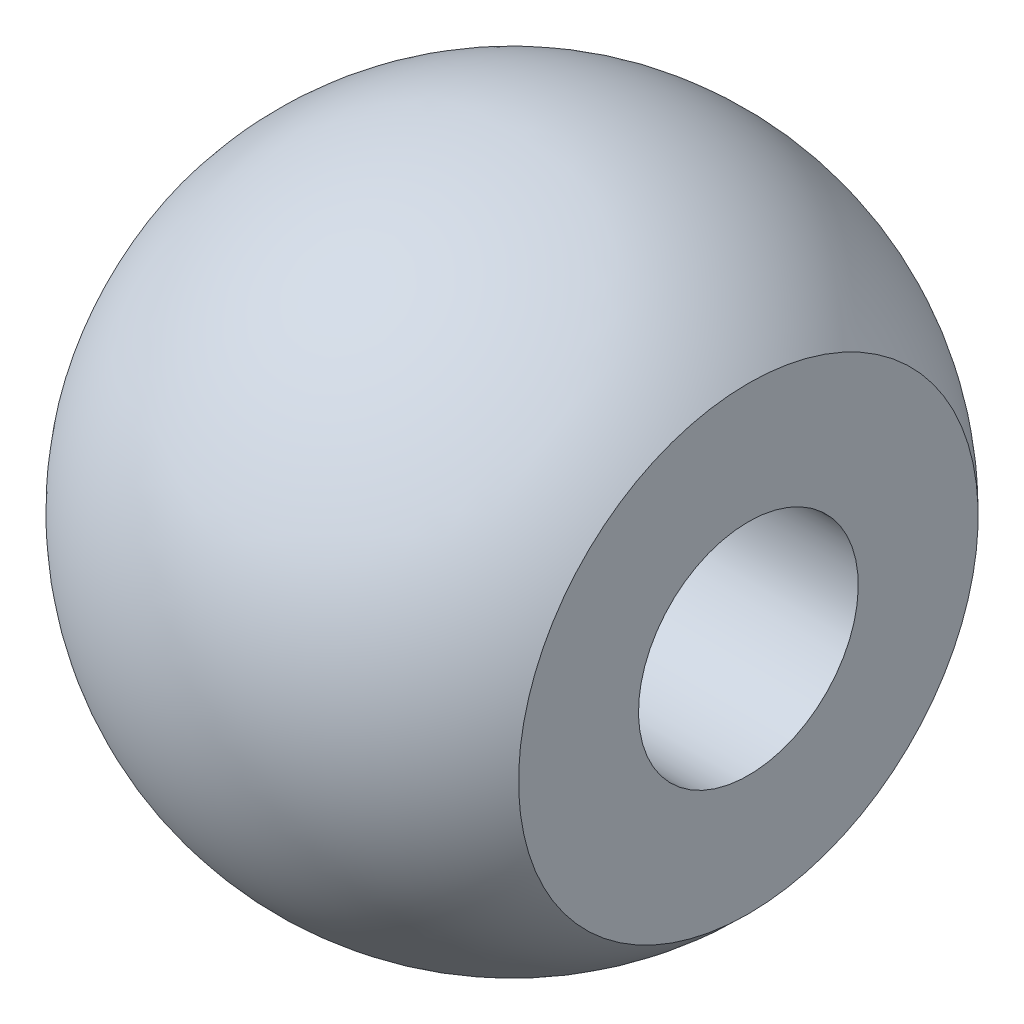
ISO-10303-21;
HEADER;
FILE_DESCRIPTION(('STEP AP214'),'2;1');
FILE_NAME('part.step','',(''),(''),'','','');
FILE_SCHEMA(('AUTOMOTIVE_DESIGN { 1 0 10303 214 1 1 1 1 }'));
ENDSEC;
DATA;
#1=APPLICATION_CONTEXT('core data for automotive mechanical design processes');
#2=APPLICATION_PROTOCOL_DEFINITION('international standard','automotive_design',2000,#1);
#3=PRODUCT_CONTEXT('',#1,'mechanical');
#4=PRODUCT('Part','Part','',(#3));
#5=PRODUCT_RELATED_PRODUCT_CATEGORY('part','',(#4));
#6=PRODUCT_DEFINITION_FORMATION('','',#4);
#7=PRODUCT_DEFINITION_CONTEXT('part definition',#1,'design');
#8=PRODUCT_DEFINITION('design','',#6,#7);
#9=PRODUCT_DEFINITION_SHAPE('','',#8);
#10=(LENGTH_UNIT() NAMED_UNIT(*) SI_UNIT(.MILLI.,.METRE.));
#11=(NAMED_UNIT(*) PLANE_ANGLE_UNIT() SI_UNIT($,.RADIAN.));
#12=(NAMED_UNIT(*) SI_UNIT($,.STERADIAN.) SOLID_ANGLE_UNIT());
#13=UNCERTAINTY_MEASURE_WITH_UNIT(LENGTH_MEASURE(1.E-05),#10,'distance_accuracy_value','');
#14=(GEOMETRIC_REPRESENTATION_CONTEXT(3) GLOBAL_UNCERTAINTY_ASSIGNED_CONTEXT((#13)) GLOBAL_UNIT_ASSIGNED_CONTEXT((#10,
#11,#12)) REPRESENTATION_CONTEXT('',''));
#15=CARTESIAN_POINT('',(0.,0.,0.));
#16=DIRECTION('',(0.,0.,1.));
#17=DIRECTION('',(1.,0.,0.));
#18=AXIS2_PLACEMENT_3D('',#15,#16,#17);
#19=CARTESIAN_POINT('',(0.,0.,0.));
#20=DIRECTION('',(1.,0.,0.));
#21=DIRECTION('',(0.,-1.,0.));
#22=AXIS2_PLACEMENT_3D('',#19,#20,#21);
#23=SPHERICAL_SURFACE('',#22,6.);
#24=CARTESIAN_POINT('',(4.30193691296887,0.,0.));
#25=DIRECTION('',(1.,0.,0.));
#26=DIRECTION('',(0.,1.,0.));
#27=AXIS2_PLACEMENT_3D('',#24,#25,#26);
#28=CIRCLE('',#27,4.18250389083332);
#29=CARTESIAN_POINT('',(4.30193691296887,4.18250389083332,0.));
#30=VERTEX_POINT('',#29);
#31=EDGE_CURVE('E10',#30,#30,#28,.T.);
#32=ORIENTED_EDGE('',*,*,#31,.F.);
#33=EDGE_LOOP('',(#32));
#34=FACE_BOUND('',#33,.T.);
#35=CARTESIAN_POINT('',(-4.69806308703112,0.,0.));
#36=DIRECTION('',(1.,0.,0.));
#37=DIRECTION('',(0.,1.,0.));
#38=AXIS2_PLACEMENT_3D('',#35,#36,#37);
#39=CIRCLE('',#38,3.73205080756889);
#40=CARTESIAN_POINT('',(-4.69806308703113,3.73205080756889,0.));
#41=VERTEX_POINT('',#40);
#42=EDGE_CURVE('E49',#41,#41,#39,.T.);
#43=ORIENTED_EDGE('',*,*,#42,.T.);
#44=EDGE_LOOP('',(#43));
#45=FACE_BOUND('',#44,.T.);
#46=ADVANCED_FACE('F35',(#34,#45),#23,.T.);
#47=CARTESIAN_POINT('',(4.30193691296887,-4.18250389083332,0.));
#48=DIRECTION('',(-1.,0.,0.));
#49=DIRECTION('',(0.,-1.,0.));
#50=AXIS2_PLACEMENT_3D('',#47,#48,#49);
#51=PLANE('',#50);
#52=CARTESIAN_POINT('',(4.30193691296887,0.,0.));
#53=DIRECTION('',(1.,0.,0.));
#54=DIRECTION('',(0.,1.,0.));
#55=AXIS2_PLACEMENT_3D('',#52,#53,#54);
#56=CIRCLE('',#55,2.);
#57=CARTESIAN_POINT('',(4.30193691296887,2.,0.));
#58=VERTEX_POINT('',#57);
#59=EDGE_CURVE('E41',#58,#58,#56,.T.);
#60=ORIENTED_EDGE('',*,*,#59,.F.);
#61=EDGE_LOOP('',(#60));
#62=FACE_BOUND('',#61,.T.);
#63=ORIENTED_EDGE('',*,*,#31,.T.);
#64=EDGE_LOOP('',(#63));
#65=FACE_BOUND('',#64,.T.);
#66=ADVANCED_FACE('F64',(#62,#65),#51,.F.);
#67=CARTESIAN_POINT('',(0.620259740260172,0.,0.));
#68=DIRECTION('',(1.,0.,0.));
#69=DIRECTION('',(0.,1.,0.));
#70=AXIS2_PLACEMENT_3D('',#67,#68,#69);
#71=CYLINDRICAL_SURFACE('',#70,2.);
#72=CARTESIAN_POINT('',(-3.69806308703112,0.,0.));
#73=DIRECTION('',(1.,0.,0.));
#74=DIRECTION('',(0.,1.,0.));
#75=AXIS2_PLACEMENT_3D('',#72,#73,#74);
#76=CIRCLE('',#75,2.);
#77=CARTESIAN_POINT('',(-3.69806308703112,2.,0.));
#78=VERTEX_POINT('',#77);
#79=EDGE_CURVE('E45',#78,#78,#76,.T.);
#80=ORIENTED_EDGE('',*,*,#79,.F.);
#81=EDGE_LOOP('',(#80));
#82=FACE_BOUND('',#81,.T.);
#83=ORIENTED_EDGE('',*,*,#59,.T.);
#84=EDGE_LOOP('',(#83));
#85=FACE_BOUND('',#84,.T.);
#86=ADVANCED_FACE('F59',(#82,#85),#71,.F.);
#87=CARTESIAN_POINT('',(-3.69806308703112,0.,0.));
#88=DIRECTION('',(-1.,0.,0.));
#89=DIRECTION('',(0.,-1.,0.));
#90=AXIS2_PLACEMENT_3D('',#87,#88,#89);
#91=CONICAL_SURFACE('',#90,2.,1.0471975511966);
#92=ORIENTED_EDGE('',*,*,#42,.F.);
#93=EDGE_LOOP('',(#92));
#94=FACE_BOUND('',#93,.T.);
#95=ORIENTED_EDGE('',*,*,#79,.T.);
#96=EDGE_LOOP('',(#95));
#97=FACE_BOUND('',#96,.T.);
#98=ADVANCED_FACE('F56',(#94,#97),#91,.F.);
#99=CLOSED_SHELL('',(#46,#66,#86,#98));
#100=MANIFOLD_SOLID_BREP('B2',#99);
#101=ADVANCED_BREP_SHAPE_REPRESENTATION('',(#18,#100),#14);
#102=SHAPE_DEFINITION_REPRESENTATION(#9,#101);
ENDSEC;
END-ISO-10303-21;
